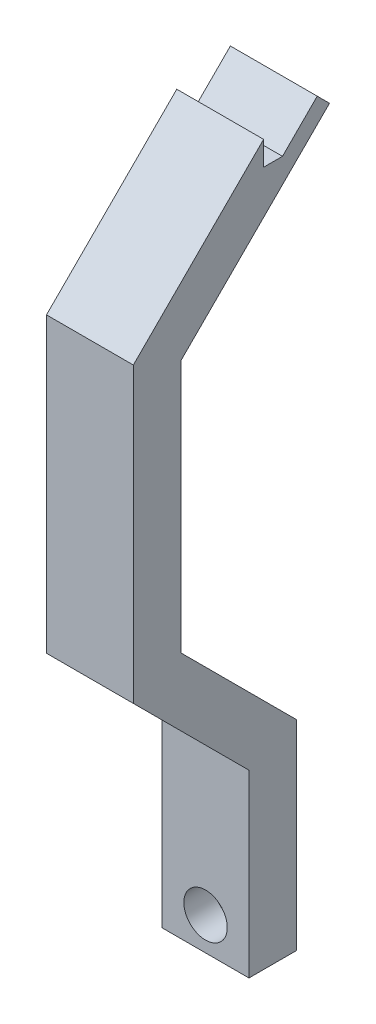
ISO-10303-21;
HEADER;
FILE_DESCRIPTION(('STEP AP214'),'2;1');
FILE_NAME('part.step','',(''),(''),'','','');
FILE_SCHEMA(('AUTOMOTIVE_DESIGN { 1 0 10303 214 1 1 1 1 }'));
ENDSEC;
DATA;
#1=APPLICATION_CONTEXT('core data for automotive mechanical design processes');
#2=APPLICATION_PROTOCOL_DEFINITION('international standard','automotive_design',2000,#1);
#3=PRODUCT_CONTEXT('',#1,'mechanical');
#4=PRODUCT('Part','Part','',(#3));
#5=PRODUCT_RELATED_PRODUCT_CATEGORY('part','',(#4));
#6=PRODUCT_DEFINITION_FORMATION('','',#4);
#7=PRODUCT_DEFINITION_CONTEXT('part definition',#1,'design');
#8=PRODUCT_DEFINITION('design','',#6,#7);
#9=PRODUCT_DEFINITION_SHAPE('','',#8);
#10=(LENGTH_UNIT() NAMED_UNIT(*) SI_UNIT(.MILLI.,.METRE.));
#11=(NAMED_UNIT(*) PLANE_ANGLE_UNIT() SI_UNIT($,.RADIAN.));
#12=(NAMED_UNIT(*) SI_UNIT($,.STERADIAN.) SOLID_ANGLE_UNIT());
#13=UNCERTAINTY_MEASURE_WITH_UNIT(LENGTH_MEASURE(1.E-05),#10,'distance_accuracy_value','');
#14=(GEOMETRIC_REPRESENTATION_CONTEXT(3) GLOBAL_UNCERTAINTY_ASSIGNED_CONTEXT((#13)) GLOBAL_UNIT_ASSIGNED_CONTEXT((#10,
#11,#12)) REPRESENTATION_CONTEXT('',''));
#15=CARTESIAN_POINT('',(0.,0.,0.));
#16=DIRECTION('',(0.,0.,1.));
#17=DIRECTION('',(1.,0.,0.));
#18=AXIS2_PLACEMENT_3D('',#15,#16,#17);
#19=CARTESIAN_POINT('',(0.,92.7234748115211,17.4142135623731));
#20=DIRECTION('',(0.,0.,1.));
#21=DIRECTION('',(1.,0.,0.));
#22=AXIS2_PLACEMENT_3D('',#19,#20,#21);
#23=CYLINDRICAL_SURFACE('',#22,1.625);
#24=CARTESIAN_POINT('',(0.,92.7234748115211,21.1884572681199));
#25=DIRECTION('',(0.,0.,1.));
#26=DIRECTION('',(0.,-1.,0.));
#27=AXIS2_PLACEMENT_3D('',#24,#25,#26);
#28=CIRCLE('',#27,1.625);
#29=CARTESIAN_POINT('',(0.,91.0984748115211,21.1884572681199));
#30=VERTEX_POINT('',#29);
#31=EDGE_CURVE('E165',#30,#30,#28,.T.);
#32=ORIENTED_EDGE('',*,*,#31,.F.);
#33=EDGE_LOOP('',(#32));
#34=FACE_BOUND('',#33,.T.);
#35=CARTESIAN_POINT('',(0.,92.7234748115211,23.1884572681199));
#36=DIRECTION('',(0.,0.,1.));
#37=DIRECTION('',(1.,0.,0.));
#38=AXIS2_PLACEMENT_3D('',#35,#36,#37);
#39=CIRCLE('',#38,1.625);
#40=CARTESIAN_POINT('',(1.625,92.7234748115211,23.1884572681199));
#41=VERTEX_POINT('',#40);
#42=EDGE_CURVE('E37',#41,#41,#39,.F.);
#43=ORIENTED_EDGE('',*,*,#42,.F.);
#44=EDGE_LOOP('',(#43));
#45=FACE_BOUND('',#44,.T.);
#46=ADVANCED_FACE('F33',(#34,#45),#23,.F.);
#47=CARTESIAN_POINT('',(5.,111.944905660377,21.1884572681199));
#48=DIRECTION('',(0.,0.,1.));
#49=DIRECTION('',(0.,-1.,0.));
#50=AXIS2_PLACEMENT_3D('',#47,#48,#49);
#51=PLANE('',#50);
#52=ORIENTED_EDGE('',*,*,#31,.T.);
#53=EDGE_LOOP('',(#52));
#54=FACE_BOUND('',#53,.T.);
#55=DIRECTION('',(0.,1.,0.));
#56=VECTOR('',#55,1.);
#57=CARTESIAN_POINT('',(-5.,111.944905660377,21.1884572681199));
#58=LINE('',#57,#56);
#59=CARTESIAN_POINT('',(-5.,88.9449056603774,21.1884572681199));
#60=VERTEX_POINT('',#59);
#61=CARTESIAN_POINT('',(-5.,111.944905660377,21.1884572681199));
#62=VERTEX_POINT('',#61);
#63=EDGE_CURVE('E161',#60,#62,#58,.T.);
#64=ORIENTED_EDGE('',*,*,#63,.T.);
#65=DIRECTION('',(-1.,0.,0.));
#66=VECTOR('',#65,1.);
#67=CARTESIAN_POINT('',(5.,111.944905660377,21.1884572681199));
#68=LINE('',#67,#66);
#69=CARTESIAN_POINT('',(5.,111.944905660377,21.1884572681199));
#70=VERTEX_POINT('',#69);
#71=EDGE_CURVE('E11',#70,#62,#68,.T.);
#72=ORIENTED_EDGE('',*,*,#71,.F.);
#73=DIRECTION('',(0.,1.,0.));
#74=VECTOR('',#73,1.);
#75=CARTESIAN_POINT('',(5.,111.944905660377,21.1884572681199));
#76=LINE('',#75,#74);
#77=CARTESIAN_POINT('',(5.,88.9449056603774,21.1884572681199));
#78=VERTEX_POINT('',#77);
#79=EDGE_CURVE('E186',#78,#70,#76,.T.);
#80=ORIENTED_EDGE('',*,*,#79,.F.);
#81=DIRECTION('',(-1.,0.,0.));
#82=VECTOR('',#81,1.);
#83=CARTESIAN_POINT('',(5.,88.9449056603774,21.1884572681199));
#84=LINE('',#83,#82);
#85=EDGE_CURVE('E157',#78,#60,#84,.T.);
#86=ORIENTED_EDGE('',*,*,#85,.T.);
#87=EDGE_LOOP('',(#64,#72,#80,#86));
#88=FACE_BOUND('',#87,.T.);
#89=ADVANCED_FACE('F35',(#54,#88),#51,.F.);
#90=CARTESIAN_POINT('',(5.,125.256448392257,34.5));
#91=DIRECTION('',(0.,-0.707106781186551,0.707106781186544));
#92=DIRECTION('',(0.,-0.707106781186544,-0.707106781186551));
#93=AXIS2_PLACEMENT_3D('',#90,#91,#92);
#94=PLANE('',#93);
#95=DIRECTION('',(0.,0.707106781186544,0.707106781186551));
#96=VECTOR('',#95,1.);
#97=CARTESIAN_POINT('',(-5.,125.256448392257,34.5));
#98=LINE('',#97,#96);
#99=CARTESIAN_POINT('',(-5.,125.256448392257,34.5));
#100=VERTEX_POINT('',#99);
#101=EDGE_CURVE('E164',#62,#100,#98,.T.);
#102=ORIENTED_EDGE('',*,*,#101,.T.);
#103=DIRECTION('',(-1.,0.,0.));
#104=VECTOR('',#103,1.);
#105=CARTESIAN_POINT('',(5.,125.256448392257,34.5));
#106=LINE('',#105,#104);
#107=CARTESIAN_POINT('',(5.,125.256448392257,34.5));
#108=VERTEX_POINT('',#107);
#109=EDGE_CURVE('E43',#108,#100,#106,.T.);
#110=ORIENTED_EDGE('',*,*,#109,.F.);
#111=DIRECTION('',(0.,0.707106781186544,0.707106781186551));
#112=VECTOR('',#111,1.);
#113=CARTESIAN_POINT('',(5.,125.256448392257,34.5));
#114=LINE('',#113,#112);
#115=EDGE_CURVE('E109',#70,#108,#114,.T.);
#116=ORIENTED_EDGE('',*,*,#115,.F.);
#117=ORIENTED_EDGE('',*,*,#71,.T.);
#118=EDGE_LOOP('',(#102,#110,#116,#117));
#119=FACE_BOUND('',#118,.T.);
#120=ADVANCED_FACE('F279',(#119),#94,.F.);
#121=CARTESIAN_POINT('',(5.,154.444905660377,34.5));
#122=DIRECTION('',(0.,0.,1.));
#123=DIRECTION('',(0.,-1.,0.));
#124=AXIS2_PLACEMENT_3D('',#121,#122,#123);
#125=PLANE('',#124);
#126=DIRECTION('',(0.,1.,0.));
#127=VECTOR('',#126,1.);
#128=CARTESIAN_POINT('',(-5.,154.444905660377,34.5));
#129=LINE('',#128,#127);
#130=CARTESIAN_POINT('',(-5.,154.444905660377,34.5));
#131=VERTEX_POINT('',#130);
#132=EDGE_CURVE('E167',#100,#131,#129,.T.);
#133=ORIENTED_EDGE('',*,*,#132,.T.);
#134=DIRECTION('',(-1.,0.,0.));
#135=VECTOR('',#134,1.);
#136=CARTESIAN_POINT('',(5.,154.444905660377,34.5));
#137=LINE('',#136,#135);
#138=CARTESIAN_POINT('',(5.,154.444905660377,34.5));
#139=VERTEX_POINT('',#138);
#140=EDGE_CURVE('E208',#139,#131,#137,.T.);
#141=ORIENTED_EDGE('',*,*,#140,.F.);
#142=DIRECTION('',(0.,1.,0.));
#143=VECTOR('',#142,1.);
#144=CARTESIAN_POINT('',(5.,154.444905660377,34.5));
#145=LINE('',#144,#143);
#146=EDGE_CURVE('E217',#108,#139,#145,.T.);
#147=ORIENTED_EDGE('',*,*,#146,.F.);
#148=ORIENTED_EDGE('',*,*,#109,.T.);
#149=EDGE_LOOP('',(#133,#141,#147,#148));
#150=FACE_BOUND('',#149,.T.);
#151=ADVANCED_FACE('F215',(#150),#125,.F.);
#152=CARTESIAN_POINT('',(5.,171.530692098004,17.4142135623731));
#153=DIRECTION('',(0.,0.707106781186544,0.707106781186552));
#154=DIRECTION('',(0.,-0.707106781186551,0.707106781186544));
#155=AXIS2_PLACEMENT_3D('',#152,#153,#154);
#156=PLANE('',#155);
#157=DIRECTION('',(0.,0.707106781186552,-0.707106781186544));
#158=VECTOR('',#157,1.);
#159=CARTESIAN_POINT('',(-5.,171.530692098004,17.4142135623731));
#160=LINE('',#159,#158);
#161=CARTESIAN_POINT('',(-5.,171.530692098004,17.4142135623731));
#162=VERTEX_POINT('',#161);
#163=EDGE_CURVE('E169',#131,#162,#160,.T.);
#164=ORIENTED_EDGE('',*,*,#163,.T.);
#165=DIRECTION('',(-1.,0.,0.));
#166=VECTOR('',#165,1.);
#167=CARTESIAN_POINT('',(5.,171.530692098004,17.4142135623731));
#168=LINE('',#167,#166);
#169=CARTESIAN_POINT('',(5.,171.530692098004,17.4142135623731));
#170=VERTEX_POINT('',#169);
#171=EDGE_CURVE('E205',#170,#162,#168,.T.);
#172=ORIENTED_EDGE('',*,*,#171,.F.);
#173=DIRECTION('',(0.,0.707106781186552,-0.707106781186544));
#174=VECTOR('',#173,1.);
#175=CARTESIAN_POINT('',(5.,171.530692098004,17.4142135623731));
#176=LINE('',#175,#174);
#177=EDGE_CURVE('E235',#139,#170,#176,.T.);
#178=ORIENTED_EDGE('',*,*,#177,.F.);
#179=ORIENTED_EDGE('',*,*,#140,.T.);
#180=EDGE_LOOP('',(#164,#172,#178,#179));
#181=FACE_BOUND('',#180,.T.);
#182=ADVANCED_FACE('F226',(#181),#156,.F.);
#183=CARTESIAN_POINT('',(5.,172.944905660377,18.8284271247462));
#184=DIRECTION('',(0.,-0.707106781186551,0.707106781186544));
#185=DIRECTION('',(0.,-0.707106781186544,-0.707106781186551));
#186=AXIS2_PLACEMENT_3D('',#183,#184,#185);
#187=PLANE('',#186);
#188=DIRECTION('',(0.,0.707106781186544,0.707106781186551));
#189=VECTOR('',#188,1.);
#190=CARTESIAN_POINT('',(-5.,172.944905660377,18.8284271247462));
#191=LINE('',#190,#189);
#192=CARTESIAN_POINT('',(-5.,172.944905660377,18.8284271247462));
#193=VERTEX_POINT('',#192);
#194=EDGE_CURVE('E171',#162,#193,#191,.T.);
#195=ORIENTED_EDGE('',*,*,#194,.T.);
#196=DIRECTION('',(-1.,0.,0.));
#197=VECTOR('',#196,1.);
#198=CARTESIAN_POINT('',(5.,172.944905660377,18.8284271247462));
#199=LINE('',#198,#197);
#200=CARTESIAN_POINT('',(5.,172.944905660377,18.8284271247462));
#201=VERTEX_POINT('',#200);
#202=EDGE_CURVE('E202',#201,#193,#199,.T.);
#203=ORIENTED_EDGE('',*,*,#202,.F.);
#204=DIRECTION('',(0.,0.707106781186544,0.707106781186551));
#205=VECTOR('',#204,1.);
#206=CARTESIAN_POINT('',(5.,172.944905660377,18.8284271247462));
#207=LINE('',#206,#205);
#208=EDGE_CURVE('E232',#170,#201,#207,.T.);
#209=ORIENTED_EDGE('',*,*,#208,.F.);
#210=ORIENTED_EDGE('',*,*,#171,.T.);
#211=EDGE_LOOP('',(#195,#203,#209,#210));
#212=FACE_BOUND('',#211,.T.);
#213=ADVANCED_FACE('F230',(#212),#187,.F.);
#214=CARTESIAN_POINT('',(5.,168.944905660377,22.8284271247461));
#215=DIRECTION('',(0.,-0.707106781186543,-0.707106781186552));
#216=DIRECTION('',(0.,0.707106781186552,-0.707106781186543));
#217=AXIS2_PLACEMENT_3D('',#214,#215,#216);
#218=PLANE('',#217);
#219=DIRECTION('',(0.,-0.707106781186552,0.707106781186543));
#220=VECTOR('',#219,1.);
#221=CARTESIAN_POINT('',(-5.,168.944905660377,22.8284271247461));
#222=LINE('',#221,#220);
#223=CARTESIAN_POINT('',(-5.,168.944905660377,22.8284271247461));
#224=VERTEX_POINT('',#223);
#225=EDGE_CURVE('E173',#193,#224,#222,.T.);
#226=ORIENTED_EDGE('',*,*,#225,.T.);
#227=DIRECTION('',(-1.,0.,0.));
#228=VECTOR('',#227,1.);
#229=CARTESIAN_POINT('',(5.,168.944905660377,22.8284271247461));
#230=LINE('',#229,#228);
#231=CARTESIAN_POINT('',(5.,168.944905660377,22.8284271247461));
#232=VERTEX_POINT('',#231);
#233=EDGE_CURVE('E199',#232,#224,#230,.T.);
#234=ORIENTED_EDGE('',*,*,#233,.F.);
#235=DIRECTION('',(0.,-0.707106781186552,0.707106781186543));
#236=VECTOR('',#235,1.);
#237=CARTESIAN_POINT('',(5.,168.944905660377,22.8284271247461));
#238=LINE('',#237,#236);
#239=EDGE_CURVE('E234',#201,#232,#238,.T.);
#240=ORIENTED_EDGE('',*,*,#239,.F.);
#241=ORIENTED_EDGE('',*,*,#202,.T.);
#242=EDGE_LOOP('',(#226,#234,#240,#241));
#243=FACE_BOUND('',#242,.T.);
#244=ADVANCED_FACE('F386',(#243),#218,.F.);
#245=CARTESIAN_POINT('',(5.,168.944905660377,25.));
#246=DIRECTION('',(0.,-1.,0.));
#247=DIRECTION('',(0.,0.,-1.));
#248=AXIS2_PLACEMENT_3D('',#245,#246,#247);
#249=PLANE('',#248);
#250=DIRECTION('',(0.,0.,1.));
#251=VECTOR('',#250,1.);
#252=CARTESIAN_POINT('',(-5.,168.944905660377,25.));
#253=LINE('',#252,#251);
#254=CARTESIAN_POINT('',(-5.,168.944905660377,25.));
#255=VERTEX_POINT('',#254);
#256=EDGE_CURVE('E175',#224,#255,#253,.T.);
#257=ORIENTED_EDGE('',*,*,#256,.T.);
#258=DIRECTION('',(-1.,0.,0.));
#259=VECTOR('',#258,1.);
#260=CARTESIAN_POINT('',(5.,168.944905660377,25.));
#261=LINE('',#260,#259);
#262=CARTESIAN_POINT('',(5.,168.944905660377,25.));
#263=VERTEX_POINT('',#262);
#264=EDGE_CURVE('E196',#263,#255,#261,.T.);
#265=ORIENTED_EDGE('',*,*,#264,.F.);
#266=DIRECTION('',(0.,0.,1.));
#267=VECTOR('',#266,1.);
#268=CARTESIAN_POINT('',(5.,168.944905660377,25.));
#269=LINE('',#268,#267);
#270=EDGE_CURVE('E237',#232,#263,#269,.T.);
#271=ORIENTED_EDGE('',*,*,#270,.F.);
#272=ORIENTED_EDGE('',*,*,#233,.T.);
#273=EDGE_LOOP('',(#257,#265,#271,#272));
#274=FACE_BOUND('',#273,.T.);
#275=ADVANCED_FACE('F376',(#274),#249,.F.);
#276=CARTESIAN_POINT('',(5.,171.723080253429,25.));
#277=DIRECTION('',(0.,0.,1.));
#278=DIRECTION('',(0.,-1.,0.));
#279=AXIS2_PLACEMENT_3D('',#276,#277,#278);
#280=PLANE('',#279);
#281=DIRECTION('',(0.,1.,0.));
#282=VECTOR('',#281,1.);
#283=CARTESIAN_POINT('',(-5.,171.723080253429,25.));
#284=LINE('',#283,#282);
#285=CARTESIAN_POINT('',(-5.,171.723080253429,25.));
#286=VERTEX_POINT('',#285);
#287=EDGE_CURVE('E177',#255,#286,#284,.T.);
#288=ORIENTED_EDGE('',*,*,#287,.T.);
#289=DIRECTION('',(-1.,0.,0.));
#290=VECTOR('',#289,1.);
#291=CARTESIAN_POINT('',(5.,171.723080253429,25.));
#292=LINE('',#291,#290);
#293=CARTESIAN_POINT('',(5.,171.723080253429,25.));
#294=VERTEX_POINT('',#293);
#295=EDGE_CURVE('E193',#294,#286,#292,.T.);
#296=ORIENTED_EDGE('',*,*,#295,.F.);
#297=DIRECTION('',(0.,1.,0.));
#298=VECTOR('',#297,1.);
#299=CARTESIAN_POINT('',(5.,171.723080253429,25.));
#300=LINE('',#299,#298);
#301=EDGE_CURVE('E243',#263,#294,#300,.T.);
#302=ORIENTED_EDGE('',*,*,#301,.F.);
#303=ORIENTED_EDGE('',*,*,#264,.T.);
#304=EDGE_LOOP('',(#288,#296,#302,#303));
#305=FACE_BOUND('',#304,.T.);
#306=ADVANCED_FACE('F367',(#305),#280,.F.);
#307=CARTESIAN_POINT('',(5.,156.723080253429,40.));
#308=DIRECTION('',(0.,-0.707106781186543,-0.707106781186552));
#309=DIRECTION('',(0.,0.707106781186552,-0.707106781186543));
#310=AXIS2_PLACEMENT_3D('',#307,#308,#309);
#311=PLANE('',#310);
#312=DIRECTION('',(0.,-0.707106781186552,0.707106781186543));
#313=VECTOR('',#312,1.);
#314=CARTESIAN_POINT('',(-5.,156.723080253429,40.));
#315=LINE('',#314,#313);
#316=CARTESIAN_POINT('',(-5.,156.723080253429,40.));
#317=VERTEX_POINT('',#316);
#318=EDGE_CURVE('E179',#286,#317,#315,.T.);
#319=ORIENTED_EDGE('',*,*,#318,.T.);
#320=DIRECTION('',(-1.,0.,0.));
#321=VECTOR('',#320,1.);
#322=CARTESIAN_POINT('',(5.,156.723080253429,40.));
#323=LINE('',#322,#321);
#324=CARTESIAN_POINT('',(5.,156.723080253429,40.));
#325=VERTEX_POINT('',#324);
#326=EDGE_CURVE('E190',#325,#317,#323,.T.);
#327=ORIENTED_EDGE('',*,*,#326,.F.);
#328=DIRECTION('',(0.,-0.707106781186552,0.707106781186543));
#329=VECTOR('',#328,1.);
#330=CARTESIAN_POINT('',(5.,156.723080253429,40.));
#331=LINE('',#330,#329);
#332=EDGE_CURVE('E245',#294,#325,#331,.T.);
#333=ORIENTED_EDGE('',*,*,#332,.F.);
#334=ORIENTED_EDGE('',*,*,#295,.T.);
#335=EDGE_LOOP('',(#319,#327,#333,#334));
#336=FACE_BOUND('',#335,.T.);
#337=ADVANCED_FACE('F251',(#336),#311,.F.);
#338=CARTESIAN_POINT('',(5.,122.978273799205,40.));
#339=DIRECTION('',(0.,0.,-1.));
#340=DIRECTION('',(-1.,0.,0.));
#341=AXIS2_PLACEMENT_3D('',#338,#339,#340);
#342=PLANE('',#341);
#343=DIRECTION('',(0.,-1.,0.));
#344=VECTOR('',#343,1.);
#345=CARTESIAN_POINT('',(-5.,122.978273799205,40.));
#346=LINE('',#345,#344);
#347=CARTESIAN_POINT('',(-5.,122.978273799205,40.));
#348=VERTEX_POINT('',#347);
#349=EDGE_CURVE('E181',#317,#348,#346,.T.);
#350=ORIENTED_EDGE('',*,*,#349,.T.);
#351=DIRECTION('',(-1.,0.,0.));
#352=VECTOR('',#351,1.);
#353=CARTESIAN_POINT('',(5.,122.978273799205,40.));
#354=LINE('',#353,#352);
#355=CARTESIAN_POINT('',(5.,122.978273799205,40.));
#356=VERTEX_POINT('',#355);
#357=EDGE_CURVE('E152',#356,#348,#354,.T.);
#358=ORIENTED_EDGE('',*,*,#357,.F.);
#359=DIRECTION('',(0.,-1.,0.));
#360=VECTOR('',#359,1.);
#361=CARTESIAN_POINT('',(5.,122.978273799205,40.));
#362=LINE('',#361,#360);
#363=EDGE_CURVE('E143',#325,#356,#362,.T.);
#364=ORIENTED_EDGE('',*,*,#363,.F.);
#365=ORIENTED_EDGE('',*,*,#326,.T.);
#366=EDGE_LOOP('',(#350,#358,#364,#365));
#367=FACE_BOUND('',#366,.T.);
#368=ADVANCED_FACE('F255',(#367),#342,.F.);
#369=CARTESIAN_POINT('',(5.,109.666731067325,26.6884572681199));
#370=DIRECTION('',(0.,0.707106781186552,-0.707106781186543));
#371=DIRECTION('',(0.,0.707106781186543,0.707106781186552));
#372=AXIS2_PLACEMENT_3D('',#369,#370,#371);
#373=PLANE('',#372);
#374=DIRECTION('',(0.,-0.707106781186543,-0.707106781186552));
#375=VECTOR('',#374,1.);
#376=CARTESIAN_POINT('',(-5.,109.666731067325,26.6884572681199));
#377=LINE('',#376,#375);
#378=CARTESIAN_POINT('',(-5.,109.666731067325,26.6884572681199));
#379=VERTEX_POINT('',#378);
#380=EDGE_CURVE('E151',#348,#379,#377,.T.);
#381=ORIENTED_EDGE('',*,*,#380,.T.);
#382=DIRECTION('',(-1.,0.,0.));
#383=VECTOR('',#382,1.);
#384=CARTESIAN_POINT('',(5.,109.666731067325,26.6884572681199));
#385=LINE('',#384,#383);
#386=CARTESIAN_POINT('',(5.,109.666731067325,26.6884572681199));
#387=VERTEX_POINT('',#386);
#388=EDGE_CURVE('E148',#387,#379,#385,.T.);
#389=ORIENTED_EDGE('',*,*,#388,.F.);
#390=DIRECTION('',(0.,-0.707106781186543,-0.707106781186552));
#391=VECTOR('',#390,1.);
#392=CARTESIAN_POINT('',(5.,109.666731067325,26.6884572681199));
#393=LINE('',#392,#391);
#394=EDGE_CURVE('E137',#356,#387,#393,.T.);
#395=ORIENTED_EDGE('',*,*,#394,.F.);
#396=ORIENTED_EDGE('',*,*,#357,.T.);
#397=EDGE_LOOP('',(#381,#389,#395,#396));
#398=FACE_BOUND('',#397,.T.);
#399=ADVANCED_FACE('F149',(#398),#373,.F.);
#400=CARTESIAN_POINT('',(5.,88.9449056603774,26.6884572681199));
#401=DIRECTION('',(0.,0.,-1.));
#402=DIRECTION('',(-1.,0.,0.));
#403=AXIS2_PLACEMENT_3D('',#400,#401,#402);
#404=PLANE('',#403);
#405=CARTESIAN_POINT('',(0.,92.7234748115211,26.6884572681199));
#406=DIRECTION('',(0.,0.,1.));
#407=DIRECTION('',(1.,0.,0.));
#408=AXIS2_PLACEMENT_3D('',#405,#406,#407);
#409=CIRCLE('',#408,2.5);
#410=CARTESIAN_POINT('',(2.5,92.7234748115211,26.6884572681199));
#411=VERTEX_POINT('',#410);
#412=EDGE_CURVE('E302',#411,#411,#409,.T.);
#413=ORIENTED_EDGE('',*,*,#412,.F.);
#414=EDGE_LOOP('',(#413));
#415=FACE_BOUND('',#414,.T.);
#416=DIRECTION('',(0.,-1.,0.));
#417=VECTOR('',#416,1.);
#418=CARTESIAN_POINT('',(-5.,88.9449056603774,26.6884572681199));
#419=LINE('',#418,#417);
#420=CARTESIAN_POINT('',(-5.,88.9449056603774,26.6884572681199));
#421=VERTEX_POINT('',#420);
#422=EDGE_CURVE('E95',#379,#421,#419,.T.);
#423=ORIENTED_EDGE('',*,*,#422,.T.);
#424=DIRECTION('',(-1.,0.,0.));
#425=VECTOR('',#424,1.);
#426=CARTESIAN_POINT('',(5.,88.9449056603774,26.6884572681199));
#427=LINE('',#426,#425);
#428=CARTESIAN_POINT('',(5.,88.9449056603774,26.6884572681199));
#429=VERTEX_POINT('',#428);
#430=EDGE_CURVE('E153',#429,#421,#427,.T.);
#431=ORIENTED_EDGE('',*,*,#430,.F.);
#432=DIRECTION('',(0.,-1.,0.));
#433=VECTOR('',#432,1.);
#434=CARTESIAN_POINT('',(5.,88.9449056603774,26.6884572681199));
#435=LINE('',#434,#433);
#436=EDGE_CURVE('E141',#387,#429,#435,.T.);
#437=ORIENTED_EDGE('',*,*,#436,.F.);
#438=ORIENTED_EDGE('',*,*,#388,.T.);
#439=EDGE_LOOP('',(#423,#431,#437,#438));
#440=FACE_BOUND('',#439,.T.);
#441=ADVANCED_FACE('F155',(#415,#440),#404,.F.);
#442=CARTESIAN_POINT('',(5.,88.9449056603774,21.1884572681199));
#443=DIRECTION('',(0.,1.,0.));
#444=DIRECTION('',(0.,0.,1.));
#445=AXIS2_PLACEMENT_3D('',#442,#443,#444);
#446=PLANE('',#445);
#447=DIRECTION('',(0.,0.,-1.));
#448=VECTOR('',#447,1.);
#449=CARTESIAN_POINT('',(-5.,88.9449056603774,21.1884572681199));
#450=LINE('',#449,#448);
#451=EDGE_CURVE('E101',#421,#60,#450,.T.);
#452=ORIENTED_EDGE('',*,*,#451,.T.);
#453=ORIENTED_EDGE('',*,*,#85,.F.);
#454=DIRECTION('',(0.,0.,-1.));
#455=VECTOR('',#454,1.);
#456=CARTESIAN_POINT('',(5.,88.9449056603774,21.1884572681199));
#457=LINE('',#456,#455);
#458=EDGE_CURVE('E51',#429,#78,#457,.T.);
#459=ORIENTED_EDGE('',*,*,#458,.F.);
#460=ORIENTED_EDGE('',*,*,#430,.T.);
#461=EDGE_LOOP('',(#452,#453,#459,#460));
#462=FACE_BOUND('',#461,.T.);
#463=ADVANCED_FACE('F259',(#462),#446,.F.);
#464=CARTESIAN_POINT('',(5.,0.,0.));
#465=DIRECTION('',(-1.,0.,0.));
#466=DIRECTION('',(0.,0.,1.));
#467=AXIS2_PLACEMENT_3D('',#464,#465,#466);
#468=PLANE('',#467);
#469=ORIENTED_EDGE('',*,*,#79,.T.);
#470=ORIENTED_EDGE('',*,*,#115,.T.);
#471=ORIENTED_EDGE('',*,*,#146,.T.);
#472=ORIENTED_EDGE('',*,*,#177,.T.);
#473=ORIENTED_EDGE('',*,*,#208,.T.);
#474=ORIENTED_EDGE('',*,*,#239,.T.);
#475=ORIENTED_EDGE('',*,*,#270,.T.);
#476=ORIENTED_EDGE('',*,*,#301,.T.);
#477=ORIENTED_EDGE('',*,*,#332,.T.);
#478=ORIENTED_EDGE('',*,*,#363,.T.);
#479=ORIENTED_EDGE('',*,*,#394,.T.);
#480=ORIENTED_EDGE('',*,*,#436,.T.);
#481=ORIENTED_EDGE('',*,*,#458,.T.);
#482=EDGE_LOOP('',(#469,#470,#471,#472,#473,#474,#475,#476,#477,#478,#479,#480,#481));
#483=FACE_BOUND('',#482,.T.);
#484=ADVANCED_FACE('F139',(#483),#468,.F.);
#485=CARTESIAN_POINT('',(-5.,0.,0.));
#486=DIRECTION('',(-1.,0.,0.));
#487=DIRECTION('',(0.,0.,1.));
#488=AXIS2_PLACEMENT_3D('',#485,#486,#487);
#489=PLANE('',#488);
#490=ORIENTED_EDGE('',*,*,#63,.F.);
#491=ORIENTED_EDGE('',*,*,#451,.F.);
#492=ORIENTED_EDGE('',*,*,#422,.F.);
#493=ORIENTED_EDGE('',*,*,#380,.F.);
#494=ORIENTED_EDGE('',*,*,#349,.F.);
#495=ORIENTED_EDGE('',*,*,#318,.F.);
#496=ORIENTED_EDGE('',*,*,#287,.F.);
#497=ORIENTED_EDGE('',*,*,#256,.F.);
#498=ORIENTED_EDGE('',*,*,#225,.F.);
#499=ORIENTED_EDGE('',*,*,#194,.F.);
#500=ORIENTED_EDGE('',*,*,#163,.F.);
#501=ORIENTED_EDGE('',*,*,#132,.F.);
#502=ORIENTED_EDGE('',*,*,#101,.F.);
#503=EDGE_LOOP('',(#490,#491,#492,#493,#494,#495,#496,#497,#498,#499,#500,#501,#502));
#504=FACE_BOUND('',#503,.T.);
#505=ADVANCED_FACE('F221',(#504),#489,.T.);
#506=CARTESIAN_POINT('',(0.,92.7234748115211,23.1884572681199));
#507=DIRECTION('',(0.,0.,1.));
#508=DIRECTION('',(1.,0.,0.));
#509=AXIS2_PLACEMENT_3D('',#506,#507,#508);
#510=PLANE('',#509);
#511=CARTESIAN_POINT('',(0.,92.7234748115211,23.1884572681199));
#512=DIRECTION('',(0.,0.,1.));
#513=DIRECTION('',(1.,0.,0.));
#514=AXIS2_PLACEMENT_3D('',#511,#512,#513);
#515=CIRCLE('',#514,2.5);
#516=CARTESIAN_POINT('',(2.5,92.7234748115211,23.1884572681199));
#517=VERTEX_POINT('',#516);
#518=EDGE_CURVE('E297',#517,#517,#515,.T.);
#519=ORIENTED_EDGE('',*,*,#518,.T.);
#520=EDGE_LOOP('',(#519));
#521=FACE_BOUND('',#520,.T.);
#522=ORIENTED_EDGE('',*,*,#42,.T.);
#523=EDGE_LOOP('',(#522));
#524=FACE_BOUND('',#523,.T.);
#525=ADVANCED_FACE('F286',(#521,#524),#510,.T.);
#526=CARTESIAN_POINT('',(0.,92.7234748115211,23.1884572681199));
#527=DIRECTION('',(0.,0.,1.));
#528=DIRECTION('',(1.,0.,0.));
#529=AXIS2_PLACEMENT_3D('',#526,#527,#528);
#530=CYLINDRICAL_SURFACE('',#529,2.5);
#531=ORIENTED_EDGE('',*,*,#518,.F.);
#532=EDGE_LOOP('',(#531));
#533=FACE_BOUND('',#532,.T.);
#534=ORIENTED_EDGE('',*,*,#412,.T.);
#535=EDGE_LOOP('',(#534));
#536=FACE_BOUND('',#535,.T.);
#537=ADVANCED_FACE('F284',(#533,#536),#530,.F.);
#538=CLOSED_SHELL('',(#46,#89,#120,#151,#182,#213,#244,#275,#306,#337,#368,#399,#441,#463,#484,
#505,#525,#537));
#539=MANIFOLD_SOLID_BREP('B2',#538);
#540=ADVANCED_BREP_SHAPE_REPRESENTATION('',(#18,#539),#14);
#541=SHAPE_DEFINITION_REPRESENTATION(#9,#540);
ENDSEC;
END-ISO-10303-21;
